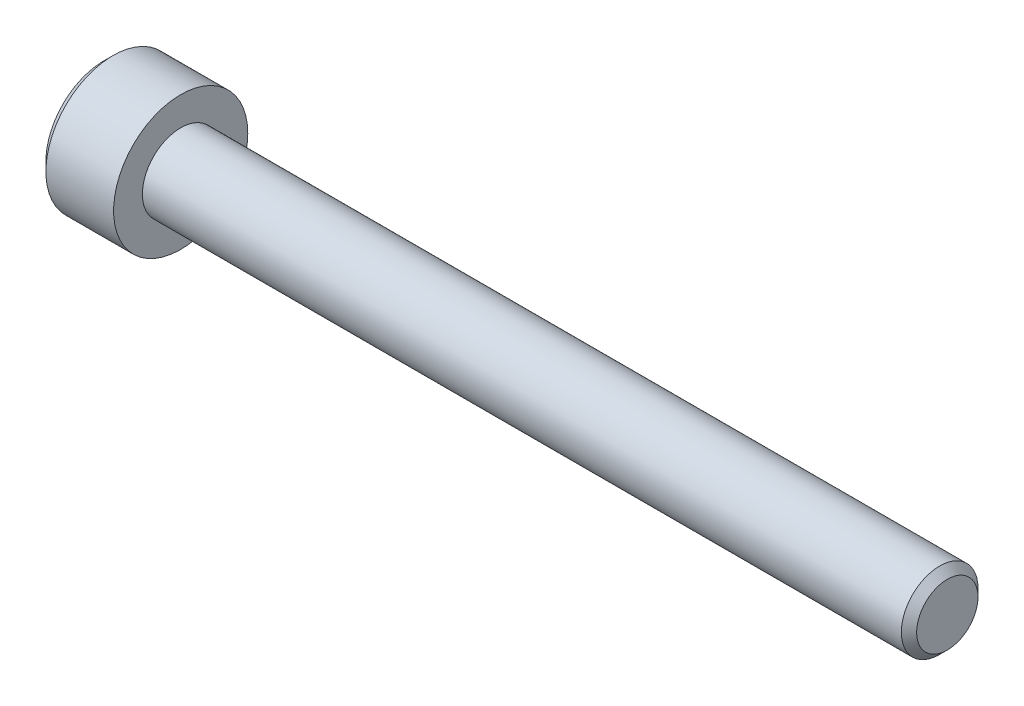
ISO-10303-21;
HEADER;
FILE_DESCRIPTION(('STEP AP214'),'2;1');
FILE_NAME('part.step','',(''),(''),'','','');
FILE_SCHEMA(('AUTOMOTIVE_DESIGN { 1 0 10303 214 1 1 1 1 }'));
ENDSEC;
DATA;
#1=APPLICATION_CONTEXT('core data for automotive mechanical design processes');
#2=APPLICATION_PROTOCOL_DEFINITION('international standard','automotive_design',2000,#1);
#3=PRODUCT_CONTEXT('',#1,'mechanical');
#4=PRODUCT('Part','Part','',(#3));
#5=PRODUCT_RELATED_PRODUCT_CATEGORY('part','',(#4));
#6=PRODUCT_DEFINITION_FORMATION('','',#4);
#7=PRODUCT_DEFINITION_CONTEXT('part definition',#1,'design');
#8=PRODUCT_DEFINITION('design','',#6,#7);
#9=PRODUCT_DEFINITION_SHAPE('','',#8);
#10=(LENGTH_UNIT() NAMED_UNIT(*) SI_UNIT(.MILLI.,.METRE.));
#11=(NAMED_UNIT(*) PLANE_ANGLE_UNIT() SI_UNIT($,.RADIAN.));
#12=(NAMED_UNIT(*) SI_UNIT($,.STERADIAN.) SOLID_ANGLE_UNIT());
#13=UNCERTAINTY_MEASURE_WITH_UNIT(LENGTH_MEASURE(1.E-05),#10,'distance_accuracy_value','');
#14=(GEOMETRIC_REPRESENTATION_CONTEXT(3) GLOBAL_UNCERTAINTY_ASSIGNED_CONTEXT((#13)) GLOBAL_UNIT_ASSIGNED_CONTEXT((#10,
#11,#12)) REPRESENTATION_CONTEXT('',''));
#15=CARTESIAN_POINT('',(0.,0.,0.));
#16=DIRECTION('',(0.,0.,1.));
#17=DIRECTION('',(1.,0.,0.));
#18=AXIS2_PLACEMENT_3D('',#15,#16,#17);
#19=CARTESIAN_POINT('',(-2.,0.,0.));
#20=DIRECTION('',(-1.,0.,0.));
#21=DIRECTION('',(0.,0.,1.));
#22=AXIS2_PLACEMENT_3D('',#19,#20,#21);
#23=CONICAL_SURFACE('',#22,1.5,1.30899693899575);
#24=CARTESIAN_POINT('',(-2.,0.,0.));
#25=DIRECTION('',(1.,0.,0.));
#26=DIRECTION('',(0.,0.,-1.));
#27=AXIS2_PLACEMENT_3D('',#24,#25,#26);
#28=CIRCLE('',#27,1.5);
#29=CARTESIAN_POINT('',(-2.,1.29903810567666,-0.75));
#30=VERTEX_POINT('',#29);
#31=CARTESIAN_POINT('',(-2.,1.29903810567666,0.75));
#32=VERTEX_POINT('',#31);
#33=EDGE_CURVE('E174',#30,#32,#28,.T.);
#34=ORIENTED_EDGE('',*,*,#33,.F.);
#35=CARTESIAN_POINT('',(-2.,0.,0.));
#36=DIRECTION('',(1.,0.,0.));
#37=DIRECTION('',(0.,0.,-1.));
#38=AXIS2_PLACEMENT_3D('',#35,#36,#37);
#39=CIRCLE('',#38,1.5);
#40=CARTESIAN_POINT('',(-2.,0.,-1.5));
#41=VERTEX_POINT('',#40);
#42=EDGE_CURVE('E277',#41,#30,#39,.T.);
#43=ORIENTED_EDGE('',*,*,#42,.F.);
#44=CARTESIAN_POINT('',(-2.,0.,0.));
#45=DIRECTION('',(1.,0.,0.));
#46=DIRECTION('',(0.,0.,-1.));
#47=AXIS2_PLACEMENT_3D('',#44,#45,#46);
#48=CIRCLE('',#47,1.5);
#49=CARTESIAN_POINT('',(-2.,-1.29903810567666,-0.75));
#50=VERTEX_POINT('',#49);
#51=EDGE_CURVE('E285',#50,#41,#48,.T.);
#52=ORIENTED_EDGE('',*,*,#51,.F.);
#53=CARTESIAN_POINT('',(-2.,0.,0.));
#54=DIRECTION('',(1.,0.,0.));
#55=DIRECTION('',(0.,0.,-1.));
#56=AXIS2_PLACEMENT_3D('',#53,#54,#55);
#57=CIRCLE('',#56,1.5);
#58=CARTESIAN_POINT('',(-2.,-1.29903810567666,0.75));
#59=VERTEX_POINT('',#58);
#60=EDGE_CURVE('E158',#59,#50,#57,.T.);
#61=ORIENTED_EDGE('',*,*,#60,.F.);
#62=CARTESIAN_POINT('',(-2.,0.,0.));
#63=DIRECTION('',(1.,0.,0.));
#64=DIRECTION('',(0.,0.,-1.));
#65=AXIS2_PLACEMENT_3D('',#62,#63,#64);
#66=CIRCLE('',#65,1.5);
#67=CARTESIAN_POINT('',(-2.,0.,1.5));
#68=VERTEX_POINT('',#67);
#69=EDGE_CURVE('E155',#68,#59,#66,.T.);
#70=ORIENTED_EDGE('',*,*,#69,.F.);
#71=CARTESIAN_POINT('',(-2.,0.,0.));
#72=DIRECTION('',(1.,0.,0.));
#73=DIRECTION('',(0.,0.,-1.));
#74=AXIS2_PLACEMENT_3D('',#71,#72,#73);
#75=CIRCLE('',#74,1.5);
#76=EDGE_CURVE('E70',#32,#68,#75,.T.);
#77=ORIENTED_EDGE('',*,*,#76,.F.);
#78=EDGE_LOOP('',(#34,#43,#52,#61,#70,#77));
#79=FACE_BOUND('',#78,.T.);
#80=CARTESIAN_POINT('',(-1.59807621135332,0.,0.));
#81=VERTEX_POINT('',#80);
#82=VERTEX_LOOP('',#81);
#83=FACE_BOUND('',#82,.T.);
#84=ADVANCED_FACE('F49',(#79,#83),#23,.F.);
#85=CARTESIAN_POINT('',(-2.,0.,0.));
#86=DIRECTION('',(1.,0.,0.));
#87=DIRECTION('',(0.,1.,0.));
#88=AXIS2_PLACEMENT_3D('',#85,#86,#87);
#89=PLANE('',#88);
#90=ORIENTED_EDGE('',*,*,#51,.T.);
#91=DIRECTION('',(0.,1.,0.));
#92=VECTOR('',#91,1.);
#93=CARTESIAN_POINT('',(-2.,-0.866025403784439,-1.5));
#94=LINE('',#93,#92);
#95=CARTESIAN_POINT('',(-2.,-0.866025403784439,-1.5));
#96=VERTEX_POINT('',#95);
#97=EDGE_CURVE('E250',#96,#41,#94,.T.);
#98=ORIENTED_EDGE('',*,*,#97,.F.);
#99=DIRECTION('',(0.,0.5,-0.866025403784439));
#100=VECTOR('',#99,1.);
#101=CARTESIAN_POINT('',(-2.,-1.73205080756888,0.));
#102=LINE('',#101,#100);
#103=EDGE_CURVE('E243',#50,#96,#102,.T.);
#104=ORIENTED_EDGE('',*,*,#103,.F.);
#105=EDGE_LOOP('',(#90,#98,#104));
#106=FACE_BOUND('',#105,.T.);
#107=ADVANCED_FACE('F301',(#106),#89,.F.);
#108=CARTESIAN_POINT('',(-2.,0.,0.));
#109=DIRECTION('',(1.,0.,0.));
#110=DIRECTION('',(0.,1.,0.));
#111=AXIS2_PLACEMENT_3D('',#108,#109,#110);
#112=PLANE('',#111);
#113=ORIENTED_EDGE('',*,*,#60,.T.);
#114=DIRECTION('',(0.,0.5,-0.866025403784439));
#115=VECTOR('',#114,1.);
#116=CARTESIAN_POINT('',(-2.,-1.73205080756888,0.));
#117=LINE('',#116,#115);
#118=CARTESIAN_POINT('',(-2.,-1.73205080756888,0.));
#119=VERTEX_POINT('',#118);
#120=EDGE_CURVE('E239',#119,#50,#117,.T.);
#121=ORIENTED_EDGE('',*,*,#120,.F.);
#122=DIRECTION('',(0.,-0.5,-0.866025403784439));
#123=VECTOR('',#122,1.);
#124=CARTESIAN_POINT('',(-2.,-0.866025403784439,1.5));
#125=LINE('',#124,#123);
#126=EDGE_CURVE('E232',#59,#119,#125,.T.);
#127=ORIENTED_EDGE('',*,*,#126,.F.);
#128=EDGE_LOOP('',(#113,#121,#127));
#129=FACE_BOUND('',#128,.T.);
#130=ADVANCED_FACE('F307',(#129),#112,.F.);
#131=CARTESIAN_POINT('',(-2.,0.,0.));
#132=DIRECTION('',(1.,0.,0.));
#133=DIRECTION('',(0.,1.,0.));
#134=AXIS2_PLACEMENT_3D('',#131,#132,#133);
#135=PLANE('',#134);
#136=ORIENTED_EDGE('',*,*,#69,.T.);
#137=DIRECTION('',(0.,-0.5,-0.866025403784439));
#138=VECTOR('',#137,1.);
#139=CARTESIAN_POINT('',(-2.,-0.866025403784439,1.5));
#140=LINE('',#139,#138);
#141=CARTESIAN_POINT('',(-2.,-0.866025403784439,1.5));
#142=VERTEX_POINT('',#141);
#143=EDGE_CURVE('E180',#142,#59,#140,.T.);
#144=ORIENTED_EDGE('',*,*,#143,.F.);
#145=DIRECTION('',(0.,-1.,0.));
#146=VECTOR('',#145,1.);
#147=CARTESIAN_POINT('',(-2.,0.866025403784439,1.5));
#148=LINE('',#147,#146);
#149=EDGE_CURVE('E177',#68,#142,#148,.T.);
#150=ORIENTED_EDGE('',*,*,#149,.F.);
#151=EDGE_LOOP('',(#136,#144,#150));
#152=FACE_BOUND('',#151,.T.);
#153=ADVANCED_FACE('F178',(#152),#135,.F.);
#154=CARTESIAN_POINT('',(-2.,0.,0.));
#155=DIRECTION('',(1.,0.,0.));
#156=DIRECTION('',(0.,1.,0.));
#157=AXIS2_PLACEMENT_3D('',#154,#155,#156);
#158=PLANE('',#157);
#159=ORIENTED_EDGE('',*,*,#76,.T.);
#160=DIRECTION('',(0.,-1.,0.));
#161=VECTOR('',#160,1.);
#162=CARTESIAN_POINT('',(-2.,0.866025403784439,1.5));
#163=LINE('',#162,#161);
#164=CARTESIAN_POINT('',(-2.,0.866025403784439,1.5));
#165=VERTEX_POINT('',#164);
#166=EDGE_CURVE('E169',#165,#68,#163,.T.);
#167=ORIENTED_EDGE('',*,*,#166,.F.);
#168=DIRECTION('',(0.,-0.5,0.866025403784439));
#169=VECTOR('',#168,1.);
#170=CARTESIAN_POINT('',(-2.,1.73205080756888,0.));
#171=LINE('',#170,#169);
#172=EDGE_CURVE('E171',#32,#165,#171,.T.);
#173=ORIENTED_EDGE('',*,*,#172,.F.);
#174=EDGE_LOOP('',(#159,#167,#173));
#175=FACE_BOUND('',#174,.T.);
#176=ADVANCED_FACE('F167',(#175),#158,.F.);
#177=CARTESIAN_POINT('',(-2.,0.,0.));
#178=DIRECTION('',(1.,0.,0.));
#179=DIRECTION('',(0.,1.,0.));
#180=AXIS2_PLACEMENT_3D('',#177,#178,#179);
#181=PLANE('',#180);
#182=DIRECTION('',(0.,0.5,0.866025403784439));
#183=VECTOR('',#182,1.);
#184=CARTESIAN_POINT('',(-2.,0.866025403784439,-1.5));
#185=LINE('',#184,#183);
#186=CARTESIAN_POINT('',(-2.,1.73205080756888,0.));
#187=VERTEX_POINT('',#186);
#188=EDGE_CURVE('E265',#30,#187,#185,.T.);
#189=ORIENTED_EDGE('',*,*,#188,.F.);
#190=ORIENTED_EDGE('',*,*,#33,.T.);
#191=DIRECTION('',(0.,-0.5,0.866025403784439));
#192=VECTOR('',#191,1.);
#193=CARTESIAN_POINT('',(-2.,1.73205080756888,0.));
#194=LINE('',#193,#192);
#195=EDGE_CURVE('E272',#187,#32,#194,.T.);
#196=ORIENTED_EDGE('',*,*,#195,.F.);
#197=EDGE_LOOP('',(#189,#190,#196));
#198=FACE_BOUND('',#197,.T.);
#199=ADVANCED_FACE('F316',(#198),#181,.F.);
#200=CARTESIAN_POINT('',(-2.,0.,0.));
#201=DIRECTION('',(1.,0.,0.));
#202=DIRECTION('',(0.,1.,0.));
#203=AXIS2_PLACEMENT_3D('',#200,#201,#202);
#204=PLANE('',#203);
#205=ORIENTED_EDGE('',*,*,#42,.T.);
#206=DIRECTION('',(0.,0.5,0.866025403784439));
#207=VECTOR('',#206,1.);
#208=CARTESIAN_POINT('',(-2.,0.866025403784439,-1.5));
#209=LINE('',#208,#207);
#210=CARTESIAN_POINT('',(-2.,0.866025403784438,-1.5));
#211=VERTEX_POINT('',#210);
#212=EDGE_CURVE('E261',#211,#30,#209,.T.);
#213=ORIENTED_EDGE('',*,*,#212,.F.);
#214=DIRECTION('',(0.,1.,0.));
#215=VECTOR('',#214,1.);
#216=CARTESIAN_POINT('',(-2.,-0.866025403784439,-1.5));
#217=LINE('',#216,#215);
#218=EDGE_CURVE('E254',#41,#211,#217,.T.);
#219=ORIENTED_EDGE('',*,*,#218,.F.);
#220=EDGE_LOOP('',(#205,#213,#219));
#221=FACE_BOUND('',#220,.T.);
#222=ADVANCED_FACE('F319',(#221),#204,.F.);
#223=CARTESIAN_POINT('',(-2.,1.73205080756888,0.));
#224=DIRECTION('',(0.,-0.866025403784439,-0.5));
#225=DIRECTION('',(0.,0.5,-0.866025403784439));
#226=AXIS2_PLACEMENT_3D('',#223,#224,#225);
#227=PLANE('',#226);
#228=DIRECTION('',(0.,-0.5,0.866025403784439));
#229=VECTOR('',#228,1.);
#230=CARTESIAN_POINT('',(-4.,1.73205080756888,0.));
#231=LINE('',#230,#229);
#232=CARTESIAN_POINT('',(-4.,1.73205080756888,0.));
#233=VERTEX_POINT('',#232);
#234=CARTESIAN_POINT('',(-4.,0.866025403784439,1.5));
#235=VERTEX_POINT('',#234);
#236=EDGE_CURVE('E208',#233,#235,#231,.T.);
#237=ORIENTED_EDGE('',*,*,#236,.F.);
#238=DIRECTION('',(-1.,0.,0.));
#239=VECTOR('',#238,1.);
#240=CARTESIAN_POINT('',(-2.,1.73205080756888,0.));
#241=LINE('',#240,#239);
#242=EDGE_CURVE('E269',#187,#233,#241,.T.);
#243=ORIENTED_EDGE('',*,*,#242,.F.);
#244=ORIENTED_EDGE('',*,*,#195,.T.);
#245=ORIENTED_EDGE('',*,*,#172,.T.);
#246=DIRECTION('',(-1.,0.,0.));
#247=VECTOR('',#246,1.);
#248=CARTESIAN_POINT('',(-2.,0.866025403784439,1.5));
#249=LINE('',#248,#247);
#250=EDGE_CURVE('E188',#165,#235,#249,.T.);
#251=ORIENTED_EDGE('',*,*,#250,.T.);
#252=EDGE_LOOP('',(#237,#243,#244,#245,#251));
#253=FACE_BOUND('',#252,.T.);
#254=ADVANCED_FACE('F322',(#253),#227,.T.);
#255=CARTESIAN_POINT('',(-2.,0.866025403784439,-1.5));
#256=DIRECTION('',(0.,-0.866025403784439,0.5));
#257=DIRECTION('',(-1.,0.,0.));
#258=AXIS2_PLACEMENT_3D('',#255,#256,#257);
#259=PLANE('',#258);
#260=DIRECTION('',(0.,0.5,0.866025403784439));
#261=VECTOR('',#260,1.);
#262=CARTESIAN_POINT('',(-4.,0.866025403784439,-1.5));
#263=LINE('',#262,#261);
#264=CARTESIAN_POINT('',(-4.,0.866025403784438,-1.5));
#265=VERTEX_POINT('',#264);
#266=EDGE_CURVE('E204',#265,#233,#263,.T.);
#267=ORIENTED_EDGE('',*,*,#266,.F.);
#268=DIRECTION('',(-1.,0.,0.));
#269=VECTOR('',#268,1.);
#270=CARTESIAN_POINT('',(-2.,0.866025403784438,-1.5));
#271=LINE('',#270,#269);
#272=EDGE_CURVE('E258',#211,#265,#271,.T.);
#273=ORIENTED_EDGE('',*,*,#272,.F.);
#274=ORIENTED_EDGE('',*,*,#212,.T.);
#275=ORIENTED_EDGE('',*,*,#188,.T.);
#276=ORIENTED_EDGE('',*,*,#242,.T.);
#277=EDGE_LOOP('',(#267,#273,#274,#275,#276));
#278=FACE_BOUND('',#277,.T.);
#279=ADVANCED_FACE('F325',(#278),#259,.T.);
#280=CARTESIAN_POINT('',(-2.,-0.866025403784439,-1.5));
#281=DIRECTION('',(0.,0.,1.));
#282=DIRECTION('',(1.,0.,0.));
#283=AXIS2_PLACEMENT_3D('',#280,#281,#282);
#284=PLANE('',#283);
#285=DIRECTION('',(0.,1.,0.));
#286=VECTOR('',#285,1.);
#287=CARTESIAN_POINT('',(-4.,-0.866025403784439,-1.5));
#288=LINE('',#287,#286);
#289=CARTESIAN_POINT('',(-4.,-0.866025403784439,-1.5));
#290=VERTEX_POINT('',#289);
#291=EDGE_CURVE('E200',#290,#265,#288,.T.);
#292=ORIENTED_EDGE('',*,*,#291,.F.);
#293=DIRECTION('',(-1.,0.,0.));
#294=VECTOR('',#293,1.);
#295=CARTESIAN_POINT('',(-2.,-0.866025403784439,-1.5));
#296=LINE('',#295,#294);
#297=EDGE_CURVE('E247',#96,#290,#296,.T.);
#298=ORIENTED_EDGE('',*,*,#297,.F.);
#299=ORIENTED_EDGE('',*,*,#97,.T.);
#300=ORIENTED_EDGE('',*,*,#218,.T.);
#301=ORIENTED_EDGE('',*,*,#272,.T.);
#302=EDGE_LOOP('',(#292,#298,#299,#300,#301));
#303=FACE_BOUND('',#302,.T.);
#304=ADVANCED_FACE('F328',(#303),#284,.T.);
#305=CARTESIAN_POINT('',(-2.,-1.73205080756888,0.));
#306=DIRECTION('',(0.,0.866025403784439,0.5));
#307=DIRECTION('',(1.,0.,0.));
#308=AXIS2_PLACEMENT_3D('',#305,#306,#307);
#309=PLANE('',#308);
#310=DIRECTION('',(0.,0.5,-0.866025403784439));
#311=VECTOR('',#310,1.);
#312=CARTESIAN_POINT('',(-4.,-1.73205080756888,0.));
#313=LINE('',#312,#311);
#314=CARTESIAN_POINT('',(-4.,-1.73205080756888,0.));
#315=VERTEX_POINT('',#314);
#316=EDGE_CURVE('E198',#315,#290,#313,.T.);
#317=ORIENTED_EDGE('',*,*,#316,.F.);
#318=DIRECTION('',(-1.,0.,0.));
#319=VECTOR('',#318,1.);
#320=CARTESIAN_POINT('',(-2.,-1.73205080756888,0.));
#321=LINE('',#320,#319);
#322=EDGE_CURVE('E236',#119,#315,#321,.T.);
#323=ORIENTED_EDGE('',*,*,#322,.F.);
#324=ORIENTED_EDGE('',*,*,#120,.T.);
#325=ORIENTED_EDGE('',*,*,#103,.T.);
#326=ORIENTED_EDGE('',*,*,#297,.T.);
#327=EDGE_LOOP('',(#317,#323,#324,#325,#326));
#328=FACE_BOUND('',#327,.T.);
#329=ADVANCED_FACE('F332',(#328),#309,.T.);
#330=CARTESIAN_POINT('',(-2.,-0.866025403784439,1.5));
#331=DIRECTION('',(0.,0.866025403784439,-0.5));
#332=DIRECTION('',(-1.,0.,0.));
#333=AXIS2_PLACEMENT_3D('',#330,#331,#332);
#334=PLANE('',#333);
#335=DIRECTION('',(0.,-0.5,-0.866025403784439));
#336=VECTOR('',#335,1.);
#337=CARTESIAN_POINT('',(-4.,-0.866025403784439,1.5));
#338=LINE('',#337,#336);
#339=CARTESIAN_POINT('',(-4.,-0.866025403784439,1.5));
#340=VERTEX_POINT('',#339);
#341=EDGE_CURVE('E216',#340,#315,#338,.T.);
#342=ORIENTED_EDGE('',*,*,#341,.F.);
#343=DIRECTION('',(-1.,0.,0.));
#344=VECTOR('',#343,1.);
#345=CARTESIAN_POINT('',(-2.,-0.866025403784439,1.5));
#346=LINE('',#345,#344);
#347=EDGE_CURVE('E184',#142,#340,#346,.T.);
#348=ORIENTED_EDGE('',*,*,#347,.F.);
#349=ORIENTED_EDGE('',*,*,#143,.T.);
#350=ORIENTED_EDGE('',*,*,#126,.T.);
#351=ORIENTED_EDGE('',*,*,#322,.T.);
#352=EDGE_LOOP('',(#342,#348,#349,#350,#351));
#353=FACE_BOUND('',#352,.T.);
#354=ADVANCED_FACE('F339',(#353),#334,.T.);
#355=CARTESIAN_POINT('',(-2.,0.866025403784439,1.5));
#356=DIRECTION('',(0.,0.,-1.));
#357=DIRECTION('',(0.,-1.,0.));
#358=AXIS2_PLACEMENT_3D('',#355,#356,#357);
#359=PLANE('',#358);
#360=DIRECTION('',(0.,-1.,0.));
#361=VECTOR('',#360,1.);
#362=CARTESIAN_POINT('',(-4.,0.866025403784439,1.5));
#363=LINE('',#362,#361);
#364=EDGE_CURVE('E212',#235,#340,#363,.T.);
#365=ORIENTED_EDGE('',*,*,#364,.F.);
#366=ORIENTED_EDGE('',*,*,#250,.F.);
#367=ORIENTED_EDGE('',*,*,#166,.T.);
#368=ORIENTED_EDGE('',*,*,#149,.T.);
#369=ORIENTED_EDGE('',*,*,#347,.T.);
#370=EDGE_LOOP('',(#365,#366,#367,#368,#369));
#371=FACE_BOUND('',#370,.T.);
#372=ADVANCED_FACE('F187',(#371),#359,.T.);
#373=CARTESIAN_POINT('',(30.,0.,0.));
#374=DIRECTION('',(1.,0.,0.));
#375=DIRECTION('',(0.,0.,-1.));
#376=AXIS2_PLACEMENT_3D('',#373,#374,#375);
#377=CYLINDRICAL_SURFACE('',#376,2.);
#378=CARTESIAN_POINT('',(39.6,0.,0.));
#379=DIRECTION('',(1.,0.,0.));
#380=DIRECTION('',(0.,0.,-1.));
#381=AXIS2_PLACEMENT_3D('',#378,#379,#380);
#382=CIRCLE('',#381,2.);
#383=CARTESIAN_POINT('',(39.6,0.,-2.));
#384=VERTEX_POINT('',#383);
#385=EDGE_CURVE('E11',#384,#384,#382,.F.);
#386=ORIENTED_EDGE('',*,*,#385,.T.);
#387=EDGE_LOOP('',(#386));
#388=FACE_BOUND('',#387,.T.);
#389=CARTESIAN_POINT('',(0.,0.,0.));
#390=DIRECTION('',(1.,0.,0.));
#391=DIRECTION('',(0.,0.,-1.));
#392=AXIS2_PLACEMENT_3D('',#389,#390,#391);
#393=CIRCLE('',#392,2.);
#394=CARTESIAN_POINT('',(0.,0.,-2.));
#395=VERTEX_POINT('',#394);
#396=EDGE_CURVE('E194',#395,#395,#393,.T.);
#397=ORIENTED_EDGE('',*,*,#396,.T.);
#398=EDGE_LOOP('',(#397));
#399=FACE_BOUND('',#398,.T.);
#400=ADVANCED_FACE('F338',(#388,#399),#377,.T.);
#401=CARTESIAN_POINT('',(0.,3.5,0.));
#402=DIRECTION('',(-1.,0.,0.));
#403=DIRECTION('',(0.,0.,1.));
#404=AXIS2_PLACEMENT_3D('',#401,#402,#403);
#405=PLANE('',#404);
#406=CARTESIAN_POINT('',(0.,0.,0.));
#407=DIRECTION('',(1.,0.,0.));
#408=DIRECTION('',(0.,0.,-1.));
#409=AXIS2_PLACEMENT_3D('',#406,#407,#408);
#410=CIRCLE('',#409,3.5);
#411=CARTESIAN_POINT('',(0.,0.,-3.5));
#412=VERTEX_POINT('',#411);
#413=EDGE_CURVE('E219',#412,#412,#410,.T.);
#414=ORIENTED_EDGE('',*,*,#413,.T.);
#415=EDGE_LOOP('',(#414));
#416=FACE_BOUND('',#415,.T.);
#417=ORIENTED_EDGE('',*,*,#396,.F.);
#418=EDGE_LOOP('',(#417));
#419=FACE_BOUND('',#418,.T.);
#420=ADVANCED_FACE('F342',(#416,#419),#405,.F.);
#421=CARTESIAN_POINT('',(30.,0.,0.));
#422=DIRECTION('',(1.,0.,0.));
#423=DIRECTION('',(0.,0.,-1.));
#424=AXIS2_PLACEMENT_3D('',#421,#422,#423);
#425=CYLINDRICAL_SURFACE('',#424,3.5);
#426=CARTESIAN_POINT('',(-3.53333333333333,0.,0.));
#427=DIRECTION('',(1.,0.,0.));
#428=DIRECTION('',(0.,0.,-1.));
#429=AXIS2_PLACEMENT_3D('',#426,#427,#428);
#430=CIRCLE('',#429,3.5);
#431=CARTESIAN_POINT('',(-3.53333333333333,0.,-3.5));
#432=VERTEX_POINT('',#431);
#433=EDGE_CURVE('E220',#432,#432,#430,.T.);
#434=ORIENTED_EDGE('',*,*,#433,.T.);
#435=EDGE_LOOP('',(#434));
#436=FACE_BOUND('',#435,.T.);
#437=ORIENTED_EDGE('',*,*,#413,.F.);
#438=EDGE_LOOP('',(#437));
#439=FACE_BOUND('',#438,.T.);
#440=ADVANCED_FACE('F349',(#436,#439),#425,.T.);
#441=CARTESIAN_POINT('',(-4.,0.,0.));
#442=DIRECTION('',(1.,0.,0.));
#443=DIRECTION('',(0.,0.,-1.));
#444=AXIS2_PLACEMENT_3D('',#441,#442,#443);
#445=CONICAL_SURFACE('',#444,3.03333333333333,0.785398163397444);
#446=CARTESIAN_POINT('',(-4.,0.,0.));
#447=DIRECTION('',(1.,0.,0.));
#448=DIRECTION('',(0.,0.,-1.));
#449=AXIS2_PLACEMENT_3D('',#446,#447,#448);
#450=CIRCLE('',#449,3.03333333333333);
#451=CARTESIAN_POINT('',(-4.,0.,-3.03333333333333));
#452=VERTEX_POINT('',#451);
#453=EDGE_CURVE('E373',#452,#452,#450,.T.);
#454=ORIENTED_EDGE('',*,*,#453,.T.);
#455=EDGE_LOOP('',(#454));
#456=FACE_BOUND('',#455,.T.);
#457=ORIENTED_EDGE('',*,*,#433,.F.);
#458=EDGE_LOOP('',(#457));
#459=FACE_BOUND('',#458,.T.);
#460=ADVANCED_FACE('F356',(#456,#459),#445,.T.);
#461=CARTESIAN_POINT('',(-4.,0.,0.));
#462=DIRECTION('',(1.,0.,0.));
#463=DIRECTION('',(0.,1.,0.));
#464=AXIS2_PLACEMENT_3D('',#461,#462,#463);
#465=PLANE('',#464);
#466=ORIENTED_EDGE('',*,*,#316,.T.);
#467=ORIENTED_EDGE('',*,*,#291,.T.);
#468=ORIENTED_EDGE('',*,*,#266,.T.);
#469=ORIENTED_EDGE('',*,*,#236,.T.);
#470=ORIENTED_EDGE('',*,*,#364,.T.);
#471=ORIENTED_EDGE('',*,*,#341,.T.);
#472=EDGE_LOOP('',(#466,#467,#468,#469,#470,#471));
#473=FACE_BOUND('',#472,.T.);
#474=ORIENTED_EDGE('',*,*,#453,.F.);
#475=EDGE_LOOP('',(#474));
#476=FACE_BOUND('',#475,.T.);
#477=ADVANCED_FACE('F297',(#473,#476),#465,.F.);
#478=CARTESIAN_POINT('',(40.,0.,0.));
#479=DIRECTION('',(1.,0.,0.));
#480=DIRECTION('',(0.,0.,-1.));
#481=AXIS2_PLACEMENT_3D('',#478,#479,#480);
#482=PLANE('',#481);
#483=CARTESIAN_POINT('',(40.,0.,0.));
#484=DIRECTION('',(1.,0.,0.));
#485=DIRECTION('',(0.,0.,-1.));
#486=AXIS2_PLACEMENT_3D('',#483,#484,#485);
#487=CIRCLE('',#486,1.60000000000001);
#488=CARTESIAN_POINT('',(40.,0.,-1.60000000000001));
#489=VERTEX_POINT('',#488);
#490=EDGE_CURVE('E59',#489,#489,#487,.T.);
#491=ORIENTED_EDGE('',*,*,#490,.T.);
#492=EDGE_LOOP('',(#491));
#493=FACE_BOUND('',#492,.T.);
#494=ADVANCED_FACE('F290',(#493),#482,.T.);
#495=CARTESIAN_POINT('',(40.,0.,0.));
#496=DIRECTION('',(-1.,0.,0.));
#497=DIRECTION('',(0.,0.,1.));
#498=AXIS2_PLACEMENT_3D('',#495,#496,#497);
#499=CONICAL_SURFACE('',#498,1.60000000000001,0.785398163397438);
#500=ORIENTED_EDGE('',*,*,#385,.F.);
#501=EDGE_LOOP('',(#500));
#502=FACE_BOUND('',#501,.T.);
#503=ORIENTED_EDGE('',*,*,#490,.F.);
#504=EDGE_LOOP('',(#503));
#505=FACE_BOUND('',#504,.T.);
#506=ADVANCED_FACE('F52',(#502,#505),#499,.T.);
#507=CLOSED_SHELL('',(#84,#107,#130,#153,#176,#199,#222,#254,#279,#304,#329,#354,#372,#400,#420,
#440,#460,#477,#494,#506));
#508=MANIFOLD_SOLID_BREP('B2',#507);
#509=ADVANCED_BREP_SHAPE_REPRESENTATION('',(#18,#508),#14);
#510=SHAPE_DEFINITION_REPRESENTATION(#9,#509);
ENDSEC;
END-ISO-10303-21;
